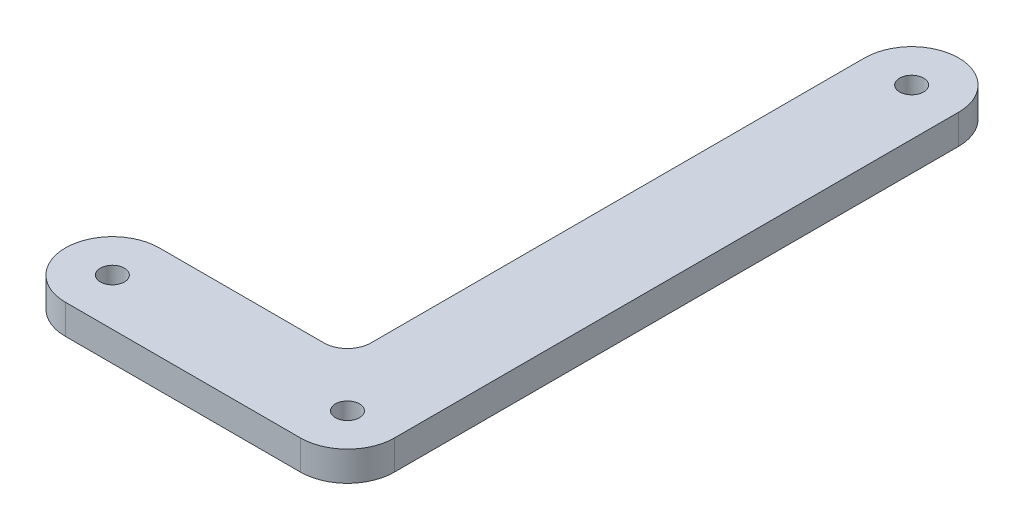
ISO-10303-21;
HEADER;
FILE_DESCRIPTION(('STEP AP214'),'2;1');
FILE_NAME('part.step','',(''),(''),'','','');
FILE_SCHEMA(('AUTOMOTIVE_DESIGN { 1 0 10303 214 1 1 1 1 }'));
ENDSEC;
DATA;
#1=APPLICATION_CONTEXT('core data for automotive mechanical design processes');
#2=APPLICATION_PROTOCOL_DEFINITION('international standard','automotive_design',2000,#1);
#3=PRODUCT_CONTEXT('',#1,'mechanical');
#4=PRODUCT('Part','Part','',(#3));
#5=PRODUCT_RELATED_PRODUCT_CATEGORY('part','',(#4));
#6=PRODUCT_DEFINITION_FORMATION('','',#4);
#7=PRODUCT_DEFINITION_CONTEXT('part definition',#1,'design');
#8=PRODUCT_DEFINITION('design','',#6,#7);
#9=PRODUCT_DEFINITION_SHAPE('','',#8);
#10=(LENGTH_UNIT() NAMED_UNIT(*) SI_UNIT(.MILLI.,.METRE.));
#11=(NAMED_UNIT(*) PLANE_ANGLE_UNIT() SI_UNIT($,.RADIAN.));
#12=(NAMED_UNIT(*) SI_UNIT($,.STERADIAN.) SOLID_ANGLE_UNIT());
#13=UNCERTAINTY_MEASURE_WITH_UNIT(LENGTH_MEASURE(1.E-05),#10,'distance_accuracy_value','');
#14=(GEOMETRIC_REPRESENTATION_CONTEXT(3) GLOBAL_UNCERTAINTY_ASSIGNED_CONTEXT((#13)) GLOBAL_UNIT_ASSIGNED_CONTEXT((#10,
#11,#12)) REPRESENTATION_CONTEXT('',''));
#15=CARTESIAN_POINT('',(0.,0.,0.));
#16=DIRECTION('',(0.,0.,1.));
#17=DIRECTION('',(1.,0.,0.));
#18=AXIS2_PLACEMENT_3D('',#15,#16,#17);
#19=CARTESIAN_POINT('',(3.60655339805825,4.,-9.525));
#20=DIRECTION('',(0.,1.,0.));
#21=DIRECTION('',(0.,0.,1.));
#22=AXIS2_PLACEMENT_3D('',#19,#20,#21);
#23=PLANE('',#22);
#24=CARTESIAN_POINT('',(13.1315533980582,4.,0.));
#25=DIRECTION('',(0.,1.,0.));
#26=DIRECTION('',(0.,0.,1.));
#27=AXIS2_PLACEMENT_3D('',#24,#25,#26);
#28=CIRCLE('',#27,1.625);
#29=CARTESIAN_POINT('',(13.1315533980582,4.,1.625));
#30=VERTEX_POINT('',#29);
#31=EDGE_CURVE('E213',#30,#30,#28,.T.);
#32=ORIENTED_EDGE('',*,*,#31,.F.);
#33=EDGE_LOOP('',(#32));
#34=FACE_BOUND('',#33,.T.);
#35=CARTESIAN_POINT('',(3.60655339805825,4.,-9.525));
#36=DIRECTION('',(0.,-1.,0.));
#37=DIRECTION('',(0.,0.,1.));
#38=AXIS2_PLACEMENT_3D('',#35,#36,#37);
#39=CIRCLE('',#38,3.175);
#40=CARTESIAN_POINT('',(6.78155339805825,4.,-9.52500000000002));
#41=VERTEX_POINT('',#40);
#42=CARTESIAN_POINT('',(3.60655339805823,4.,-6.35));
#43=VERTEX_POINT('',#42);
#44=EDGE_CURVE('E164',#41,#43,#39,.T.);
#45=ORIENTED_EDGE('',*,*,#44,.T.);
#46=DIRECTION('',(-1.,0.,0.));
#47=VECTOR('',#46,1.);
#48=CARTESIAN_POINT('',(-18.6184466019417,4.,-6.35));
#49=LINE('',#48,#47);
#50=CARTESIAN_POINT('',(-18.6184466019417,4.,-6.35));
#51=VERTEX_POINT('',#50);
#52=EDGE_CURVE('E100',#43,#51,#49,.T.);
#53=ORIENTED_EDGE('',*,*,#52,.T.);
#54=CARTESIAN_POINT('',(-18.6184466019417,4.,0.));
#55=DIRECTION('',(0.,1.,0.));
#56=DIRECTION('',(0.,0.,1.));
#57=AXIS2_PLACEMENT_3D('',#54,#55,#56);
#58=CIRCLE('',#57,6.35);
#59=CARTESIAN_POINT('',(-18.6184466019417,4.,6.35));
#60=VERTEX_POINT('',#59);
#61=EDGE_CURVE('E185',#51,#60,#58,.T.);
#62=ORIENTED_EDGE('',*,*,#61,.T.);
#63=DIRECTION('',(1.,0.,0.));
#64=VECTOR('',#63,1.);
#65=CARTESIAN_POINT('',(-18.6184466019417,4.,6.35));
#66=LINE('',#65,#64);
#67=CARTESIAN_POINT('',(13.1315533980582,4.,6.35));
#68=VERTEX_POINT('',#67);
#69=EDGE_CURVE('E199',#60,#68,#66,.T.);
#70=ORIENTED_EDGE('',*,*,#69,.T.);
#71=CARTESIAN_POINT('',(13.1315533980582,4.,0.));
#72=DIRECTION('',(0.,1.,0.));
#73=DIRECTION('',(0.,0.,1.));
#74=AXIS2_PLACEMENT_3D('',#71,#72,#73);
#75=CIRCLE('',#74,6.35);
#76=CARTESIAN_POINT('',(19.4815533980583,4.,0.));
#77=VERTEX_POINT('',#76);
#78=EDGE_CURVE('E119',#68,#77,#75,.T.);
#79=ORIENTED_EDGE('',*,*,#78,.T.);
#80=DIRECTION('',(0.,0.,-1.));
#81=VECTOR('',#80,1.);
#82=CARTESIAN_POINT('',(19.4815533980583,4.,0.));
#83=LINE('',#82,#81);
#84=CARTESIAN_POINT('',(19.4815533980583,4.,-76.2));
#85=VERTEX_POINT('',#84);
#86=EDGE_CURVE('E113',#77,#85,#83,.T.);
#87=ORIENTED_EDGE('',*,*,#86,.T.);
#88=CARTESIAN_POINT('',(13.1315533980583,4.,-76.2));
#89=DIRECTION('',(0.,1.,0.));
#90=DIRECTION('',(0.,0.,1.));
#91=AXIS2_PLACEMENT_3D('',#88,#89,#90);
#92=CIRCLE('',#91,6.35);
#93=CARTESIAN_POINT('',(6.78155339805825,4.,-76.2));
#94=VERTEX_POINT('',#93);
#95=EDGE_CURVE('E117',#85,#94,#92,.T.);
#96=ORIENTED_EDGE('',*,*,#95,.T.);
#97=DIRECTION('',(0.,0.,1.));
#98=VECTOR('',#97,1.);
#99=CARTESIAN_POINT('',(6.78155339805825,4.,-9.52500000000002));
#100=LINE('',#99,#98);
#101=EDGE_CURVE('E57',#94,#41,#100,.T.);
#102=ORIENTED_EDGE('',*,*,#101,.T.);
#103=EDGE_LOOP('',(#45,#53,#62,#70,#79,#87,#96,#102));
#104=FACE_BOUND('',#103,.T.);
#105=CARTESIAN_POINT('',(-18.6184466019417,4.,0.));
#106=DIRECTION('',(0.,1.,0.));
#107=DIRECTION('',(0.,0.,1.));
#108=AXIS2_PLACEMENT_3D('',#105,#106,#107);
#109=CIRCLE('',#108,1.625);
#110=CARTESIAN_POINT('',(-18.6184466019417,4.,1.625));
#111=VERTEX_POINT('',#110);
#112=EDGE_CURVE('E146',#111,#111,#109,.T.);
#113=ORIENTED_EDGE('',*,*,#112,.F.);
#114=EDGE_LOOP('',(#113));
#115=FACE_BOUND('',#114,.T.);
#116=CARTESIAN_POINT('',(13.1315533980583,4.,-76.2));
#117=DIRECTION('',(0.,1.,0.));
#118=DIRECTION('',(0.,0.,1.));
#119=AXIS2_PLACEMENT_3D('',#116,#117,#118);
#120=CIRCLE('',#119,1.625);
#121=CARTESIAN_POINT('',(13.1315533980583,4.,-74.575));
#122=VERTEX_POINT('',#121);
#123=EDGE_CURVE('E221',#122,#122,#120,.T.);
#124=ORIENTED_EDGE('',*,*,#123,.F.);
#125=EDGE_LOOP('',(#124));
#126=FACE_BOUND('',#125,.T.);
#127=ADVANCED_FACE('F39',(#34,#104,#115,#126),#23,.T.);
#128=CARTESIAN_POINT('',(3.60655339805825,0.,-9.525));
#129=DIRECTION('',(0.,1.,0.));
#130=DIRECTION('',(0.,0.,1.));
#131=AXIS2_PLACEMENT_3D('',#128,#129,#130);
#132=PLANE('',#131);
#133=CARTESIAN_POINT('',(3.60655339805825,0.,-9.525));
#134=DIRECTION('',(0.,-1.,0.));
#135=DIRECTION('',(0.,0.,1.));
#136=AXIS2_PLACEMENT_3D('',#133,#134,#135);
#137=CIRCLE('',#136,3.175);
#138=CARTESIAN_POINT('',(6.78155339805825,0.,-9.52500000000002));
#139=VERTEX_POINT('',#138);
#140=CARTESIAN_POINT('',(3.60655339805823,0.,-6.35));
#141=VERTEX_POINT('',#140);
#142=EDGE_CURVE('E141',#139,#141,#137,.T.);
#143=ORIENTED_EDGE('',*,*,#142,.F.);
#144=DIRECTION('',(0.,0.,1.));
#145=VECTOR('',#144,1.);
#146=CARTESIAN_POINT('',(6.78155339805825,0.,-9.52500000000002));
#147=LINE('',#146,#145);
#148=CARTESIAN_POINT('',(6.78155339805825,0.,-76.2));
#149=VERTEX_POINT('',#148);
#150=EDGE_CURVE('E92',#149,#139,#147,.T.);
#151=ORIENTED_EDGE('',*,*,#150,.F.);
#152=CARTESIAN_POINT('',(13.1315533980583,0.,-76.2));
#153=DIRECTION('',(0.,1.,0.));
#154=DIRECTION('',(0.,0.,1.));
#155=AXIS2_PLACEMENT_3D('',#152,#153,#154);
#156=CIRCLE('',#155,6.35);
#157=CARTESIAN_POINT('',(19.4815533980583,0.,-76.2));
#158=VERTEX_POINT('',#157);
#159=EDGE_CURVE('E86',#158,#149,#156,.T.);
#160=ORIENTED_EDGE('',*,*,#159,.F.);
#161=DIRECTION('',(0.,0.,-1.));
#162=VECTOR('',#161,1.);
#163=CARTESIAN_POINT('',(19.4815533980583,0.,0.));
#164=LINE('',#163,#162);
#165=CARTESIAN_POINT('',(19.4815533980583,0.,0.));
#166=VERTEX_POINT('',#165);
#167=EDGE_CURVE('E128',#166,#158,#164,.T.);
#168=ORIENTED_EDGE('',*,*,#167,.F.);
#169=CARTESIAN_POINT('',(13.1315533980582,0.,0.));
#170=DIRECTION('',(0.,1.,0.));
#171=DIRECTION('',(0.,0.,1.));
#172=AXIS2_PLACEMENT_3D('',#169,#170,#171);
#173=CIRCLE('',#172,6.35);
#174=CARTESIAN_POINT('',(13.1315533980582,0.,6.35));
#175=VERTEX_POINT('',#174);
#176=EDGE_CURVE('E155',#175,#166,#173,.T.);
#177=ORIENTED_EDGE('',*,*,#176,.F.);
#178=DIRECTION('',(1.,0.,0.));
#179=VECTOR('',#178,1.);
#180=CARTESIAN_POINT('',(-18.6184466019417,0.,6.35));
#181=LINE('',#180,#179);
#182=CARTESIAN_POINT('',(-18.6184466019417,0.,6.35));
#183=VERTEX_POINT('',#182);
#184=EDGE_CURVE('E152',#183,#175,#181,.T.);
#185=ORIENTED_EDGE('',*,*,#184,.F.);
#186=CARTESIAN_POINT('',(-18.6184466019417,0.,0.));
#187=DIRECTION('',(0.,1.,0.));
#188=DIRECTION('',(0.,0.,1.));
#189=AXIS2_PLACEMENT_3D('',#186,#187,#188);
#190=CIRCLE('',#189,6.35);
#191=CARTESIAN_POINT('',(-18.6184466019417,0.,-6.35));
#192=VERTEX_POINT('',#191);
#193=EDGE_CURVE('E149',#192,#183,#190,.T.);
#194=ORIENTED_EDGE('',*,*,#193,.F.);
#195=DIRECTION('',(-1.,0.,0.));
#196=VECTOR('',#195,1.);
#197=CARTESIAN_POINT('',(-18.6184466019417,0.,-6.35));
#198=LINE('',#197,#196);
#199=EDGE_CURVE('E145',#141,#192,#198,.T.);
#200=ORIENTED_EDGE('',*,*,#199,.F.);
#201=EDGE_LOOP('',(#143,#151,#160,#168,#177,#185,#194,#200));
#202=FACE_BOUND('',#201,.T.);
#203=CARTESIAN_POINT('',(-18.6184466019417,0.,0.));
#204=DIRECTION('',(0.,1.,0.));
#205=DIRECTION('',(0.,0.,1.));
#206=AXIS2_PLACEMENT_3D('',#203,#204,#205);
#207=CIRCLE('',#206,1.625);
#208=CARTESIAN_POINT('',(-18.6184466019417,0.,1.625));
#209=VERTEX_POINT('',#208);
#210=EDGE_CURVE('E209',#209,#209,#207,.T.);
#211=ORIENTED_EDGE('',*,*,#210,.T.);
#212=EDGE_LOOP('',(#211));
#213=FACE_BOUND('',#212,.T.);
#214=CARTESIAN_POINT('',(13.1315533980582,0.,0.));
#215=DIRECTION('',(0.,1.,0.));
#216=DIRECTION('',(0.,0.,1.));
#217=AXIS2_PLACEMENT_3D('',#214,#215,#216);
#218=CIRCLE('',#217,1.625);
#219=CARTESIAN_POINT('',(13.1315533980582,0.,1.625));
#220=VERTEX_POINT('',#219);
#221=EDGE_CURVE('E217',#220,#220,#218,.T.);
#222=ORIENTED_EDGE('',*,*,#221,.T.);
#223=EDGE_LOOP('',(#222));
#224=FACE_BOUND('',#223,.T.);
#225=CARTESIAN_POINT('',(13.1315533980583,0.,-76.2));
#226=DIRECTION('',(0.,1.,0.));
#227=DIRECTION('',(0.,0.,1.));
#228=AXIS2_PLACEMENT_3D('',#225,#226,#227);
#229=CIRCLE('',#228,1.625);
#230=CARTESIAN_POINT('',(13.1315533980583,0.,-74.575));
#231=VERTEX_POINT('',#230);
#232=EDGE_CURVE('E225',#231,#231,#229,.T.);
#233=ORIENTED_EDGE('',*,*,#232,.T.);
#234=EDGE_LOOP('',(#233));
#235=FACE_BOUND('',#234,.T.);
#236=ADVANCED_FACE('F189',(#202,#213,#224,#235),#132,.F.);
#237=CARTESIAN_POINT('',(3.60655339805825,4.,-9.525));
#238=DIRECTION('',(0.,-1.,0.));
#239=DIRECTION('',(0.,0.,-1.));
#240=AXIS2_PLACEMENT_3D('',#237,#238,#239);
#241=CYLINDRICAL_SURFACE('',#240,3.175);
#242=ORIENTED_EDGE('',*,*,#142,.T.);
#243=DIRECTION('',(0.,-1.,0.));
#244=VECTOR('',#243,1.);
#245=CARTESIAN_POINT('',(3.60655339805823,4.,-6.35));
#246=LINE('',#245,#244);
#247=EDGE_CURVE('E11',#43,#141,#246,.T.);
#248=ORIENTED_EDGE('',*,*,#247,.F.);
#249=ORIENTED_EDGE('',*,*,#44,.F.);
#250=DIRECTION('',(0.,-1.,0.));
#251=VECTOR('',#250,1.);
#252=CARTESIAN_POINT('',(6.78155339805825,4.,-9.52500000000002));
#253=LINE('',#252,#251);
#254=EDGE_CURVE('E137',#41,#139,#253,.T.);
#255=ORIENTED_EDGE('',*,*,#254,.T.);
#256=EDGE_LOOP('',(#242,#248,#249,#255));
#257=FACE_BOUND('',#256,.T.);
#258=ADVANCED_FACE('F41',(#257),#241,.F.);
#259=CARTESIAN_POINT('',(-18.6184466019417,4.,-6.35));
#260=DIRECTION('',(0.,0.,1.));
#261=DIRECTION('',(1.,0.,0.));
#262=AXIS2_PLACEMENT_3D('',#259,#260,#261);
#263=PLANE('',#262);
#264=ORIENTED_EDGE('',*,*,#199,.T.);
#265=DIRECTION('',(0.,-1.,0.));
#266=VECTOR('',#265,1.);
#267=CARTESIAN_POINT('',(-18.6184466019417,4.,-6.35));
#268=LINE('',#267,#266);
#269=EDGE_CURVE('E49',#51,#192,#268,.T.);
#270=ORIENTED_EDGE('',*,*,#269,.F.);
#271=ORIENTED_EDGE('',*,*,#52,.F.);
#272=ORIENTED_EDGE('',*,*,#247,.T.);
#273=EDGE_LOOP('',(#264,#270,#271,#272));
#274=FACE_BOUND('',#273,.T.);
#275=ADVANCED_FACE('F260',(#274),#263,.F.);
#276=CARTESIAN_POINT('',(-18.6184466019417,4.,0.));
#277=DIRECTION('',(0.,-1.,0.));
#278=DIRECTION('',(0.,0.,-1.));
#279=AXIS2_PLACEMENT_3D('',#276,#277,#278);
#280=CYLINDRICAL_SURFACE('',#279,6.35);
#281=ORIENTED_EDGE('',*,*,#193,.T.);
#282=DIRECTION('',(0.,-1.,0.));
#283=VECTOR('',#282,1.);
#284=CARTESIAN_POINT('',(-18.6184466019417,4.,6.35));
#285=LINE('',#284,#283);
#286=EDGE_CURVE('E175',#60,#183,#285,.T.);
#287=ORIENTED_EDGE('',*,*,#286,.F.);
#288=ORIENTED_EDGE('',*,*,#61,.F.);
#289=ORIENTED_EDGE('',*,*,#269,.T.);
#290=EDGE_LOOP('',(#281,#287,#288,#289));
#291=FACE_BOUND('',#290,.T.);
#292=ADVANCED_FACE('F183',(#291),#280,.T.);
#293=CARTESIAN_POINT('',(-18.6184466019417,4.,6.35));
#294=DIRECTION('',(0.,0.,-1.));
#295=DIRECTION('',(-1.,0.,0.));
#296=AXIS2_PLACEMENT_3D('',#293,#294,#295);
#297=PLANE('',#296);
#298=ORIENTED_EDGE('',*,*,#184,.T.);
#299=DIRECTION('',(0.,-1.,0.));
#300=VECTOR('',#299,1.);
#301=CARTESIAN_POINT('',(13.1315533980582,4.,6.35));
#302=LINE('',#301,#300);
#303=EDGE_CURVE('E171',#68,#175,#302,.T.);
#304=ORIENTED_EDGE('',*,*,#303,.F.);
#305=ORIENTED_EDGE('',*,*,#69,.F.);
#306=ORIENTED_EDGE('',*,*,#286,.T.);
#307=EDGE_LOOP('',(#298,#304,#305,#306));
#308=FACE_BOUND('',#307,.T.);
#309=ADVANCED_FACE('F194',(#308),#297,.F.);
#310=CARTESIAN_POINT('',(13.1315533980582,4.,0.));
#311=DIRECTION('',(0.,-1.,0.));
#312=DIRECTION('',(0.,0.,-1.));
#313=AXIS2_PLACEMENT_3D('',#310,#311,#312);
#314=CYLINDRICAL_SURFACE('',#313,6.35);
#315=ORIENTED_EDGE('',*,*,#176,.T.);
#316=DIRECTION('',(0.,-1.,0.));
#317=VECTOR('',#316,1.);
#318=CARTESIAN_POINT('',(19.4815533980583,4.,0.));
#319=LINE('',#318,#317);
#320=EDGE_CURVE('E130',#77,#166,#319,.T.);
#321=ORIENTED_EDGE('',*,*,#320,.F.);
#322=ORIENTED_EDGE('',*,*,#78,.F.);
#323=ORIENTED_EDGE('',*,*,#303,.T.);
#324=EDGE_LOOP('',(#315,#321,#322,#323));
#325=FACE_BOUND('',#324,.T.);
#326=ADVANCED_FACE('F197',(#325),#314,.T.);
#327=CARTESIAN_POINT('',(19.4815533980583,4.,0.));
#328=DIRECTION('',(-1.,0.,0.));
#329=DIRECTION('',(0.,0.,1.));
#330=AXIS2_PLACEMENT_3D('',#327,#328,#329);
#331=PLANE('',#330);
#332=ORIENTED_EDGE('',*,*,#167,.T.);
#333=DIRECTION('',(0.,-1.,0.));
#334=VECTOR('',#333,1.);
#335=CARTESIAN_POINT('',(19.4815533980583,4.,-76.2));
#336=LINE('',#335,#334);
#337=EDGE_CURVE('E125',#85,#158,#336,.T.);
#338=ORIENTED_EDGE('',*,*,#337,.F.);
#339=ORIENTED_EDGE('',*,*,#86,.F.);
#340=ORIENTED_EDGE('',*,*,#320,.T.);
#341=EDGE_LOOP('',(#332,#338,#339,#340));
#342=FACE_BOUND('',#341,.T.);
#343=ADVANCED_FACE('F126',(#342),#331,.F.);
#344=CARTESIAN_POINT('',(13.1315533980583,4.,-76.2));
#345=DIRECTION('',(0.,-1.,0.));
#346=DIRECTION('',(0.,0.,-1.));
#347=AXIS2_PLACEMENT_3D('',#344,#345,#346);
#348=CYLINDRICAL_SURFACE('',#347,6.35);
#349=ORIENTED_EDGE('',*,*,#159,.T.);
#350=DIRECTION('',(0.,-1.,0.));
#351=VECTOR('',#350,1.);
#352=CARTESIAN_POINT('',(6.78155339805825,4.,-76.2));
#353=LINE('',#352,#351);
#354=EDGE_CURVE('E131',#94,#149,#353,.T.);
#355=ORIENTED_EDGE('',*,*,#354,.F.);
#356=ORIENTED_EDGE('',*,*,#95,.F.);
#357=ORIENTED_EDGE('',*,*,#337,.T.);
#358=EDGE_LOOP('',(#349,#355,#356,#357));
#359=FACE_BOUND('',#358,.T.);
#360=ADVANCED_FACE('F133',(#359),#348,.T.);
#361=CARTESIAN_POINT('',(6.78155339805825,4.,-9.52500000000002));
#362=DIRECTION('',(1.,0.,0.));
#363=DIRECTION('',(0.,0.,-1.));
#364=AXIS2_PLACEMENT_3D('',#361,#362,#363);
#365=PLANE('',#364);
#366=ORIENTED_EDGE('',*,*,#150,.T.);
#367=ORIENTED_EDGE('',*,*,#254,.F.);
#368=ORIENTED_EDGE('',*,*,#101,.F.);
#369=ORIENTED_EDGE('',*,*,#354,.T.);
#370=EDGE_LOOP('',(#366,#367,#368,#369));
#371=FACE_BOUND('',#370,.T.);
#372=ADVANCED_FACE('F248',(#371),#365,.F.);
#373=CARTESIAN_POINT('',(-18.6184466019417,4.,0.));
#374=DIRECTION('',(0.,-1.,0.));
#375=DIRECTION('',(0.,0.,-1.));
#376=AXIS2_PLACEMENT_3D('',#373,#374,#375);
#377=CYLINDRICAL_SURFACE('',#376,1.625);
#378=ORIENTED_EDGE('',*,*,#112,.T.);
#379=EDGE_LOOP('',(#378));
#380=FACE_BOUND('',#379,.T.);
#381=ORIENTED_EDGE('',*,*,#210,.F.);
#382=EDGE_LOOP('',(#381));
#383=FACE_BOUND('',#382,.T.);
#384=ADVANCED_FACE('F245',(#380,#383),#377,.F.);
#385=CARTESIAN_POINT('',(13.1315533980582,4.,0.));
#386=DIRECTION('',(0.,-1.,0.));
#387=DIRECTION('',(0.,0.,-1.));
#388=AXIS2_PLACEMENT_3D('',#385,#386,#387);
#389=CYLINDRICAL_SURFACE('',#388,1.625);
#390=ORIENTED_EDGE('',*,*,#31,.T.);
#391=EDGE_LOOP('',(#390));
#392=FACE_BOUND('',#391,.T.);
#393=ORIENTED_EDGE('',*,*,#221,.F.);
#394=EDGE_LOOP('',(#393));
#395=FACE_BOUND('',#394,.T.);
#396=ADVANCED_FACE('F324',(#392,#395),#389,.F.);
#397=CARTESIAN_POINT('',(13.1315533980583,4.,-76.2));
#398=DIRECTION('',(0.,-1.,0.));
#399=DIRECTION('',(0.,0.,-1.));
#400=AXIS2_PLACEMENT_3D('',#397,#398,#399);
#401=CYLINDRICAL_SURFACE('',#400,1.625);
#402=ORIENTED_EDGE('',*,*,#123,.T.);
#403=EDGE_LOOP('',(#402));
#404=FACE_BOUND('',#403,.T.);
#405=ORIENTED_EDGE('',*,*,#232,.F.);
#406=EDGE_LOOP('',(#405));
#407=FACE_BOUND('',#406,.T.);
#408=ADVANCED_FACE('F233',(#404,#407),#401,.F.);
#409=CLOSED_SHELL('',(#127,#236,#258,#275,#292,#309,#326,#343,#360,#372,#384,#396,#408));
#410=MANIFOLD_SOLID_BREP('B2',#409);
#411=ADVANCED_BREP_SHAPE_REPRESENTATION('',(#18,#410),#14);
#412=SHAPE_DEFINITION_REPRESENTATION(#9,#411);
ENDSEC;
END-ISO-10303-21;
